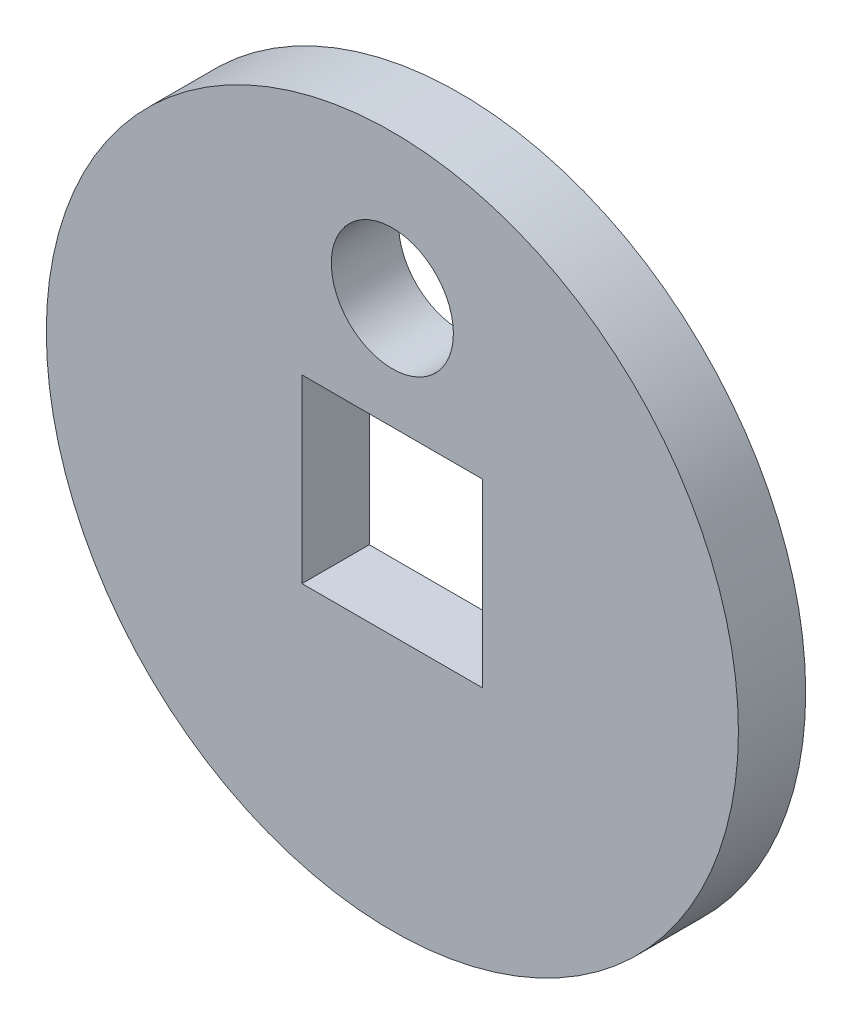
ISO-10303-21;
HEADER;
FILE_DESCRIPTION(('STEP AP214'),'2;1');
FILE_NAME('part.step','',(''),(''),'','','');
FILE_SCHEMA(('AUTOMOTIVE_DESIGN { 1 0 10303 214 1 1 1 1 }'));
ENDSEC;
DATA;
#1=APPLICATION_CONTEXT('core data for automotive mechanical design processes');
#2=APPLICATION_PROTOCOL_DEFINITION('international standard','automotive_design',2000,#1);
#3=PRODUCT_CONTEXT('',#1,'mechanical');
#4=PRODUCT('Part','Part','',(#3));
#5=PRODUCT_RELATED_PRODUCT_CATEGORY('part','',(#4));
#6=PRODUCT_DEFINITION_FORMATION('','',#4);
#7=PRODUCT_DEFINITION_CONTEXT('part definition',#1,'design');
#8=PRODUCT_DEFINITION('design','',#6,#7);
#9=PRODUCT_DEFINITION_SHAPE('','',#8);
#10=(LENGTH_UNIT() NAMED_UNIT(*) SI_UNIT(.MILLI.,.METRE.));
#11=(NAMED_UNIT(*) PLANE_ANGLE_UNIT() SI_UNIT($,.RADIAN.));
#12=(NAMED_UNIT(*) SI_UNIT($,.STERADIAN.) SOLID_ANGLE_UNIT());
#13=UNCERTAINTY_MEASURE_WITH_UNIT(LENGTH_MEASURE(1.E-05),#10,'distance_accuracy_value','');
#14=(GEOMETRIC_REPRESENTATION_CONTEXT(3) GLOBAL_UNCERTAINTY_ASSIGNED_CONTEXT((#13)) GLOBAL_UNIT_ASSIGNED_CONTEXT((#10,
#11,#12)) REPRESENTATION_CONTEXT('',''));
#15=CARTESIAN_POINT('',(0.,0.,0.));
#16=DIRECTION('',(0.,0.,1.));
#17=DIRECTION('',(1.,0.,0.));
#18=AXIS2_PLACEMENT_3D('',#15,#16,#17);
#19=CARTESIAN_POINT('',(0.,0.,1.75));
#20=DIRECTION('',(0.,0.,-1.));
#21=DIRECTION('',(-1.,0.,0.));
#22=AXIS2_PLACEMENT_3D('',#19,#20,#21);
#23=CYLINDRICAL_SURFACE('',#22,9.);
#24=CARTESIAN_POINT('',(0.,0.,1.75));
#25=DIRECTION('',(0.,0.,1.));
#26=DIRECTION('',(1.,0.,0.));
#27=AXIS2_PLACEMENT_3D('',#24,#25,#26);
#28=CIRCLE('',#27,9.);
#29=CARTESIAN_POINT('',(9.,0.,1.75));
#30=VERTEX_POINT('',#29);
#31=EDGE_CURVE('E11',#30,#30,#28,.T.);
#32=ORIENTED_EDGE('',*,*,#31,.F.);
#33=EDGE_LOOP('',(#32));
#34=FACE_BOUND('',#33,.T.);
#35=CARTESIAN_POINT('',(0.,0.,0.));
#36=DIRECTION('',(0.,0.,1.));
#37=DIRECTION('',(1.,0.,0.));
#38=AXIS2_PLACEMENT_3D('',#35,#36,#37);
#39=CIRCLE('',#38,9.);
#40=CARTESIAN_POINT('',(9.,0.,0.));
#41=VERTEX_POINT('',#40);
#42=EDGE_CURVE('E34',#41,#41,#39,.T.);
#43=ORIENTED_EDGE('',*,*,#42,.T.);
#44=EDGE_LOOP('',(#43));
#45=FACE_BOUND('',#44,.T.);
#46=ADVANCED_FACE('F31',(#34,#45),#23,.T.);
#47=CARTESIAN_POINT('',(0.,0.,1.75));
#48=DIRECTION('',(0.,0.,1.));
#49=DIRECTION('',(1.,0.,0.));
#50=AXIS2_PLACEMENT_3D('',#47,#48,#49);
#51=PLANE('',#50);
#52=CARTESIAN_POINT('',(0.,5.25,1.75));
#53=DIRECTION('',(0.,0.,1.));
#54=DIRECTION('',(1.,0.,0.));
#55=AXIS2_PLACEMENT_3D('',#52,#53,#54);
#56=CIRCLE('',#55,1.5875);
#57=CARTESIAN_POINT('',(1.5875,5.25,1.75));
#58=VERTEX_POINT('',#57);
#59=EDGE_CURVE('E95',#58,#58,#56,.T.);
#60=ORIENTED_EDGE('',*,*,#59,.F.);
#61=EDGE_LOOP('',(#60));
#62=FACE_BOUND('',#61,.T.);
#63=DIRECTION('',(0.,1.,0.));
#64=VECTOR('',#63,1.);
#65=CARTESIAN_POINT('',(2.35,-2.35,1.75));
#66=LINE('',#65,#64);
#67=CARTESIAN_POINT('',(2.35,-2.35,1.75));
#68=VERTEX_POINT('',#67);
#69=CARTESIAN_POINT('',(2.35,2.35,1.75));
#70=VERTEX_POINT('',#69);
#71=EDGE_CURVE('E45',#68,#70,#66,.T.);
#72=ORIENTED_EDGE('',*,*,#71,.F.);
#73=DIRECTION('',(1.,0.,0.));
#74=VECTOR('',#73,1.);
#75=CARTESIAN_POINT('',(-2.35,-2.35,1.75));
#76=LINE('',#75,#74);
#77=CARTESIAN_POINT('',(-2.35,-2.35,1.75));
#78=VERTEX_POINT('',#77);
#79=EDGE_CURVE('E89',#78,#68,#76,.T.);
#80=ORIENTED_EDGE('',*,*,#79,.F.);
#81=DIRECTION('',(0.,-1.,0.));
#82=VECTOR('',#81,1.);
#83=CARTESIAN_POINT('',(-2.35,-2.35,1.75));
#84=LINE('',#83,#82);
#85=CARTESIAN_POINT('',(-2.35,2.35,1.75));
#86=VERTEX_POINT('',#85);
#87=EDGE_CURVE('E92',#86,#78,#84,.T.);
#88=ORIENTED_EDGE('',*,*,#87,.F.);
#89=DIRECTION('',(-1.,0.,0.));
#90=VECTOR('',#89,1.);
#91=CARTESIAN_POINT('',(-2.35,2.35,1.75));
#92=LINE('',#91,#90);
#93=EDGE_CURVE('E101',#70,#86,#92,.T.);
#94=ORIENTED_EDGE('',*,*,#93,.F.);
#95=EDGE_LOOP('',(#72,#80,#88,#94));
#96=FACE_BOUND('',#95,.T.);
#97=ORIENTED_EDGE('',*,*,#31,.T.);
#98=EDGE_LOOP('',(#97));
#99=FACE_BOUND('',#98,.T.);
#100=ADVANCED_FACE('F114',(#62,#96,#99),#51,.T.);
#101=CARTESIAN_POINT('',(0.,0.,0.));
#102=DIRECTION('',(0.,0.,1.));
#103=DIRECTION('',(1.,0.,0.));
#104=AXIS2_PLACEMENT_3D('',#101,#102,#103);
#105=PLANE('',#104);
#106=CARTESIAN_POINT('',(0.,5.25,0.));
#107=DIRECTION('',(0.,0.,1.));
#108=DIRECTION('',(1.,0.,0.));
#109=AXIS2_PLACEMENT_3D('',#106,#107,#108);
#110=CIRCLE('',#109,1.5875);
#111=CARTESIAN_POINT('',(1.5875,5.25,0.));
#112=VERTEX_POINT('',#111);
#113=EDGE_CURVE('E102',#112,#112,#110,.T.);
#114=ORIENTED_EDGE('',*,*,#113,.T.);
#115=EDGE_LOOP('',(#114));
#116=FACE_BOUND('',#115,.T.);
#117=DIRECTION('',(1.,0.,0.));
#118=VECTOR('',#117,1.);
#119=CARTESIAN_POINT('',(-2.35,-2.35,0.));
#120=LINE('',#119,#118);
#121=CARTESIAN_POINT('',(-2.35,-2.35,0.));
#122=VERTEX_POINT('',#121);
#123=CARTESIAN_POINT('',(2.35,-2.35,0.));
#124=VERTEX_POINT('',#123);
#125=EDGE_CURVE('E79',#122,#124,#120,.T.);
#126=ORIENTED_EDGE('',*,*,#125,.T.);
#127=DIRECTION('',(0.,1.,0.));
#128=VECTOR('',#127,1.);
#129=CARTESIAN_POINT('',(2.35,-2.35,0.));
#130=LINE('',#129,#128);
#131=CARTESIAN_POINT('',(2.35,2.35,0.));
#132=VERTEX_POINT('',#131);
#133=EDGE_CURVE('E73',#124,#132,#130,.T.);
#134=ORIENTED_EDGE('',*,*,#133,.T.);
#135=DIRECTION('',(-1.,0.,0.));
#136=VECTOR('',#135,1.);
#137=CARTESIAN_POINT('',(-2.35,2.35,0.));
#138=LINE('',#137,#136);
#139=CARTESIAN_POINT('',(-2.35,2.35,0.));
#140=VERTEX_POINT('',#139);
#141=EDGE_CURVE('E82',#132,#140,#138,.T.);
#142=ORIENTED_EDGE('',*,*,#141,.T.);
#143=DIRECTION('',(0.,-1.,0.));
#144=VECTOR('',#143,1.);
#145=CARTESIAN_POINT('',(-2.35,-2.35,0.));
#146=LINE('',#145,#144);
#147=EDGE_CURVE('E53',#140,#122,#146,.T.);
#148=ORIENTED_EDGE('',*,*,#147,.T.);
#149=EDGE_LOOP('',(#126,#134,#142,#148));
#150=FACE_BOUND('',#149,.T.);
#151=ORIENTED_EDGE('',*,*,#42,.F.);
#152=EDGE_LOOP('',(#151));
#153=FACE_BOUND('',#152,.T.);
#154=ADVANCED_FACE('F86',(#116,#150,#153),#105,.F.);
#155=CARTESIAN_POINT('',(2.35,-2.35,0.));
#156=DIRECTION('',(1.,0.,0.));
#157=DIRECTION('',(0.,0.,-1.));
#158=AXIS2_PLACEMENT_3D('',#155,#156,#157);
#159=PLANE('',#158);
#160=ORIENTED_EDGE('',*,*,#71,.T.);
#161=DIRECTION('',(0.,0.,1.));
#162=VECTOR('',#161,1.);
#163=CARTESIAN_POINT('',(2.35,2.35,0.));
#164=LINE('',#163,#162);
#165=EDGE_CURVE('E69',#132,#70,#164,.T.);
#166=ORIENTED_EDGE('',*,*,#165,.F.);
#167=ORIENTED_EDGE('',*,*,#133,.F.);
#168=DIRECTION('',(0.,0.,1.));
#169=VECTOR('',#168,1.);
#170=CARTESIAN_POINT('',(2.35,-2.35,0.));
#171=LINE('',#170,#169);
#172=EDGE_CURVE('E106',#124,#68,#171,.T.);
#173=ORIENTED_EDGE('',*,*,#172,.T.);
#174=EDGE_LOOP('',(#160,#166,#167,#173));
#175=FACE_BOUND('',#174,.T.);
#176=ADVANCED_FACE('F71',(#175),#159,.F.);
#177=CARTESIAN_POINT('',(-2.35,-2.35,0.));
#178=DIRECTION('',(0.,-1.,0.));
#179=DIRECTION('',(0.,0.,-1.));
#180=AXIS2_PLACEMENT_3D('',#177,#178,#179);
#181=PLANE('',#180);
#182=ORIENTED_EDGE('',*,*,#79,.T.);
#183=ORIENTED_EDGE('',*,*,#172,.F.);
#184=ORIENTED_EDGE('',*,*,#125,.F.);
#185=DIRECTION('',(0.,0.,1.));
#186=VECTOR('',#185,1.);
#187=CARTESIAN_POINT('',(-2.35,-2.35,0.));
#188=LINE('',#187,#186);
#189=EDGE_CURVE('E108',#122,#78,#188,.T.);
#190=ORIENTED_EDGE('',*,*,#189,.T.);
#191=EDGE_LOOP('',(#182,#183,#184,#190));
#192=FACE_BOUND('',#191,.T.);
#193=ADVANCED_FACE('F117',(#192),#181,.F.);
#194=CARTESIAN_POINT('',(-2.35,-2.35,0.));
#195=DIRECTION('',(-1.,0.,0.));
#196=DIRECTION('',(0.,0.,1.));
#197=AXIS2_PLACEMENT_3D('',#194,#195,#196);
#198=PLANE('',#197);
#199=ORIENTED_EDGE('',*,*,#87,.T.);
#200=ORIENTED_EDGE('',*,*,#189,.F.);
#201=ORIENTED_EDGE('',*,*,#147,.F.);
#202=DIRECTION('',(0.,0.,1.));
#203=VECTOR('',#202,1.);
#204=CARTESIAN_POINT('',(-2.35,2.35,0.));
#205=LINE('',#204,#203);
#206=EDGE_CURVE('E78',#140,#86,#205,.T.);
#207=ORIENTED_EDGE('',*,*,#206,.T.);
#208=EDGE_LOOP('',(#199,#200,#201,#207));
#209=FACE_BOUND('',#208,.T.);
#210=ADVANCED_FACE('F110',(#209),#198,.F.);
#211=CARTESIAN_POINT('',(-2.35,2.35,0.));
#212=DIRECTION('',(0.,1.,0.));
#213=DIRECTION('',(0.,0.,1.));
#214=AXIS2_PLACEMENT_3D('',#211,#212,#213);
#215=PLANE('',#214);
#216=ORIENTED_EDGE('',*,*,#93,.T.);
#217=ORIENTED_EDGE('',*,*,#206,.F.);
#218=ORIENTED_EDGE('',*,*,#141,.F.);
#219=ORIENTED_EDGE('',*,*,#165,.T.);
#220=EDGE_LOOP('',(#216,#217,#218,#219));
#221=FACE_BOUND('',#220,.T.);
#222=ADVANCED_FACE('F83',(#221),#215,.F.);
#223=CARTESIAN_POINT('',(0.,5.25,0.));
#224=DIRECTION('',(0.,0.,1.));
#225=DIRECTION('',(1.,0.,0.));
#226=AXIS2_PLACEMENT_3D('',#223,#224,#225);
#227=CYLINDRICAL_SURFACE('',#226,1.5875);
#228=ORIENTED_EDGE('',*,*,#113,.F.);
#229=EDGE_LOOP('',(#228));
#230=FACE_BOUND('',#229,.T.);
#231=ORIENTED_EDGE('',*,*,#59,.T.);
#232=EDGE_LOOP('',(#231));
#233=FACE_BOUND('',#232,.T.);
#234=ADVANCED_FACE('F145',(#230,#233),#227,.F.);
#235=CLOSED_SHELL('',(#46,#100,#154,#176,#193,#210,#222,#234));
#236=MANIFOLD_SOLID_BREP('B2',#235);
#237=ADVANCED_BREP_SHAPE_REPRESENTATION('',(#18,#236),#14);
#238=SHAPE_DEFINITION_REPRESENTATION(#9,#237);
ENDSEC;
END-ISO-10303-21;
